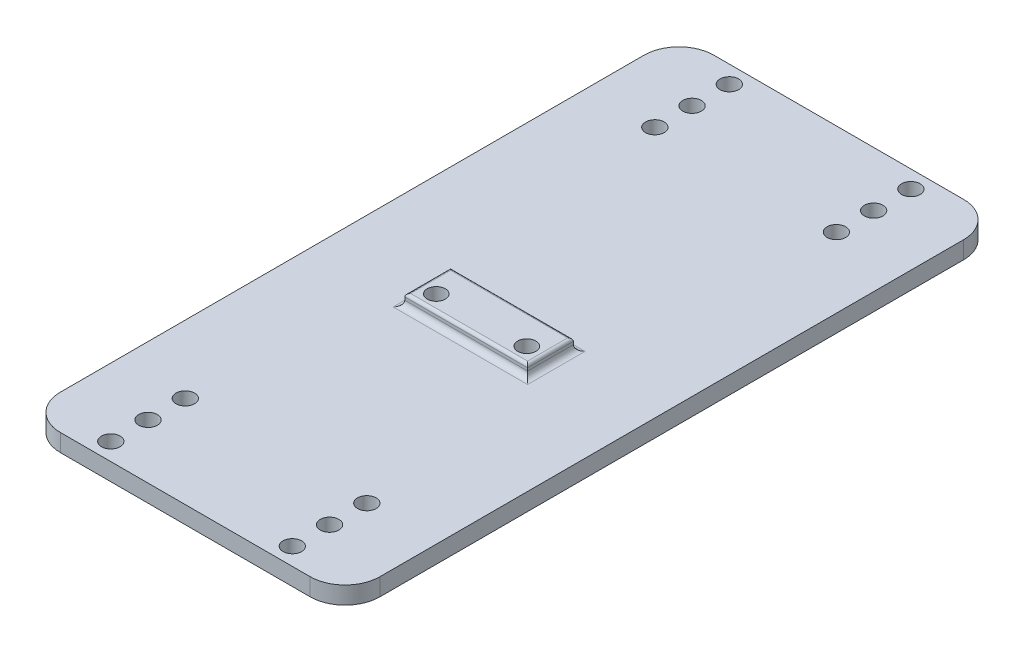
ISO-10303-21;
HEADER;
FILE_DESCRIPTION(('STEP AP214'),'2;1');
FILE_NAME('part.step','',(''),(''),'','','');
FILE_SCHEMA(('AUTOMOTIVE_DESIGN { 1 0 10303 214 1 1 1 1 }'));
ENDSEC;
DATA;
#1=APPLICATION_CONTEXT('core data for automotive mechanical design processes');
#2=APPLICATION_PROTOCOL_DEFINITION('international standard','automotive_design',2000,#1);
#3=PRODUCT_CONTEXT('',#1,'mechanical');
#4=PRODUCT('Part','Part','',(#3));
#5=PRODUCT_RELATED_PRODUCT_CATEGORY('part','',(#4));
#6=PRODUCT_DEFINITION_FORMATION('','',#4);
#7=PRODUCT_DEFINITION_CONTEXT('part definition',#1,'design');
#8=PRODUCT_DEFINITION('design','',#6,#7);
#9=PRODUCT_DEFINITION_SHAPE('','',#8);
#10=(LENGTH_UNIT() NAMED_UNIT(*) SI_UNIT(.MILLI.,.METRE.));
#11=(NAMED_UNIT(*) PLANE_ANGLE_UNIT() SI_UNIT($,.RADIAN.));
#12=(NAMED_UNIT(*) SI_UNIT($,.STERADIAN.) SOLID_ANGLE_UNIT());
#13=UNCERTAINTY_MEASURE_WITH_UNIT(LENGTH_MEASURE(1.E-05),#10,'distance_accuracy_value','');
#14=(GEOMETRIC_REPRESENTATION_CONTEXT(3) GLOBAL_UNCERTAINTY_ASSIGNED_CONTEXT((#13)) GLOBAL_UNIT_ASSIGNED_CONTEXT((#10,
#11,#12)) REPRESENTATION_CONTEXT('',''));
#15=CARTESIAN_POINT('',(0.,0.,0.));
#16=DIRECTION('',(0.,0.,1.));
#17=DIRECTION('',(1.,0.,0.));
#18=AXIS2_PLACEMENT_3D('',#15,#16,#17);
#19=CARTESIAN_POINT('',(0.,3.,0.));
#20=DIRECTION('',(0.,1.,0.));
#21=DIRECTION('',(0.,0.,1.));
#22=AXIS2_PLACEMENT_3D('',#19,#20,#21);
#23=PLANE('',#22);
#24=DIRECTION('',(1.,0.,0.));
#25=VECTOR('',#24,1.);
#26=CARTESIAN_POINT('',(0.,3.,-28.0852721253402));
#27=LINE('',#26,#25);
#28=CARTESIAN_POINT('',(-53.246105621832,3.,-28.0852721253402));
#29=VERTEX_POINT('',#28);
#30=CARTESIAN_POINT('',(-76.3535056218319,3.,-28.0852721253402));
#31=VERTEX_POINT('',#30);
#32=EDGE_CURVE('E220',#29,#31,#27,.F.);
#33=ORIENTED_EDGE('',*,*,#32,.T.);
#34=DIRECTION('',(0.,0.,-1.));
#35=VECTOR('',#34,1.);
#36=CARTESIAN_POINT('',(-76.3535056218319,3.,-36.9592721253402));
#37=LINE('',#36,#35);
#38=CARTESIAN_POINT('',(-76.3535056218319,3.,-37.9592721253402));
#39=VERTEX_POINT('',#38);
#40=EDGE_CURVE('E224',#31,#39,#37,.T.);
#41=ORIENTED_EDGE('',*,*,#40,.T.);
#42=DIRECTION('',(1.,0.,0.));
#43=VECTOR('',#42,1.);
#44=CARTESIAN_POINT('',(-54.246105621832,3.,-37.9592721253402));
#45=LINE('',#44,#43);
#46=CARTESIAN_POINT('',(-53.246105621832,3.,-37.9592721253402));
#47=VERTEX_POINT('',#46);
#48=EDGE_CURVE('E222',#39,#47,#45,.T.);
#49=ORIENTED_EDGE('',*,*,#48,.T.);
#50=DIRECTION('',(0.,0.,-1.));
#51=VECTOR('',#50,1.);
#52=CARTESIAN_POINT('',(-53.246105621832,3.,0.));
#53=LINE('',#52,#51);
#54=EDGE_CURVE('E218',#47,#29,#53,.F.);
#55=ORIENTED_EDGE('',*,*,#54,.T.);
#56=EDGE_LOOP('',(#33,#41,#49,#55));
#57=FACE_BOUND('',#56,.T.);
#58=CARTESIAN_POINT('',(-80.5998056218321,3.,-83.7102133679597));
#59=DIRECTION('',(0.,1.,0.));
#60=DIRECTION('',(0.,0.,-1.));
#61=AXIS2_PLACEMENT_3D('',#58,#59,#60);
#62=CIRCLE('',#61,1.60000000000001);
#63=CARTESIAN_POINT('',(-80.5998056218321,3.,-85.3102133679597));
#64=VERTEX_POINT('',#63);
#65=EDGE_CURVE('E331',#64,#64,#62,.T.);
#66=ORIENTED_EDGE('',*,*,#65,.F.);
#67=EDGE_LOOP('',(#66));
#68=FACE_BOUND('',#67,.T.);
#69=CARTESIAN_POINT('',(-49.3998056218321,3.,-77.3102133679595));
#70=DIRECTION('',(0.,1.,0.));
#71=DIRECTION('',(0.,0.,-1.));
#72=AXIS2_PLACEMENT_3D('',#69,#70,#71);
#73=CIRCLE('',#72,1.60000000000001);
#74=CARTESIAN_POINT('',(-49.3998056218321,3.,-78.9102133679596));
#75=VERTEX_POINT('',#74);
#76=EDGE_CURVE('E343',#75,#75,#73,.T.);
#77=ORIENTED_EDGE('',*,*,#76,.F.);
#78=EDGE_LOOP('',(#77));
#79=FACE_BOUND('',#78,.T.);
#80=CARTESIAN_POINT('',(-49.399805621832,3.,-90.1102133679596));
#81=DIRECTION('',(0.,1.,0.));
#82=DIRECTION('',(0.,0.,-1.));
#83=AXIS2_PLACEMENT_3D('',#80,#81,#82);
#84=CIRCLE('',#83,1.60000000000001);
#85=CARTESIAN_POINT('',(-49.399805621832,3.,-91.7102133679596));
#86=VERTEX_POINT('',#85);
#87=EDGE_CURVE('E355',#86,#86,#84,.T.);
#88=ORIENTED_EDGE('',*,*,#87,.F.);
#89=EDGE_LOOP('',(#88));
#90=FACE_BOUND('',#89,.T.);
#91=CARTESIAN_POINT('',(-49.399805621832,3.,9.79166911727908));
#92=DIRECTION('',(0.,1.,0.));
#93=DIRECTION('',(0.,0.,1.));
#94=AXIS2_PLACEMENT_3D('',#91,#92,#93);
#95=CIRCLE('',#94,1.6);
#96=CARTESIAN_POINT('',(-49.399805621832,3.,11.3916691172791));
#97=VERTEX_POINT('',#96);
#98=EDGE_CURVE('E367',#97,#97,#95,.T.);
#99=ORIENTED_EDGE('',*,*,#98,.F.);
#100=EDGE_LOOP('',(#99));
#101=FACE_BOUND('',#100,.T.);
#102=CARTESIAN_POINT('',(-80.5998056218321,3.,3.39166911727918));
#103=DIRECTION('',(0.,1.,0.));
#104=DIRECTION('',(0.,0.,1.));
#105=AXIS2_PLACEMENT_3D('',#102,#103,#104);
#106=CIRCLE('',#105,1.59999999999999);
#107=CARTESIAN_POINT('',(-80.5998056218321,3.,4.99166911727917));
#108=VERTEX_POINT('',#107);
#109=EDGE_CURVE('E379',#108,#108,#106,.T.);
#110=ORIENTED_EDGE('',*,*,#109,.F.);
#111=EDGE_LOOP('',(#110));
#112=FACE_BOUND('',#111,.T.);
#113=CARTESIAN_POINT('',(-80.599805621832,3.,16.1916691172792));
#114=DIRECTION('',(0.,1.,0.));
#115=DIRECTION('',(0.,0.,1.));
#116=AXIS2_PLACEMENT_3D('',#113,#114,#115);
#117=CIRCLE('',#116,1.59999999999999);
#118=CARTESIAN_POINT('',(-80.599805621832,3.,17.7916691172792));
#119=VERTEX_POINT('',#118);
#120=EDGE_CURVE('E177',#119,#119,#117,.T.);
#121=ORIENTED_EDGE('',*,*,#120,.F.);
#122=EDGE_LOOP('',(#121));
#123=FACE_BOUND('',#122,.T.);
#124=DIRECTION('',(-1.,0.,0.));
#125=VECTOR('',#124,1.);
#126=CARTESIAN_POINT('',(-92.2619387616021,3.,-93.1142721253402));
#127=LINE('',#126,#125);
#128=CARTESIAN_POINT('',(-43.3376724820618,3.,-93.1142721253402));
#129=VERTEX_POINT('',#128);
#130=CARTESIAN_POINT('',(-86.2619387616021,3.,-93.1142721253402));
#131=VERTEX_POINT('',#130);
#132=EDGE_CURVE('E186',#129,#131,#127,.T.);
#133=ORIENTED_EDGE('',*,*,#132,.T.);
#134=CARTESIAN_POINT('',(-86.2619387616021,3.,-87.1142721253402));
#135=DIRECTION('',(0.,1.,0.));
#136=DIRECTION('',(0.,0.,1.));
#137=AXIS2_PLACEMENT_3D('',#134,#135,#136);
#138=CIRCLE('',#137,6.);
#139=CARTESIAN_POINT('',(-92.2619387616021,3.,-87.1142721253402));
#140=VERTEX_POINT('',#139);
#141=EDGE_CURVE('E206',#131,#140,#138,.T.);
#142=ORIENTED_EDGE('',*,*,#141,.T.);
#143=DIRECTION('',(0.,0.,1.));
#144=VECTOR('',#143,1.);
#145=CARTESIAN_POINT('',(-92.2619387616021,3.,-93.1142721253402));
#146=LINE('',#145,#144);
#147=CARTESIAN_POINT('',(-92.2619387616021,3.,13.1957278746598));
#148=VERTEX_POINT('',#147);
#149=EDGE_CURVE('E168',#140,#148,#146,.T.);
#150=ORIENTED_EDGE('',*,*,#149,.T.);
#151=CARTESIAN_POINT('',(-86.2619387616021,3.,13.1957278746598));
#152=DIRECTION('',(0.,1.,0.));
#153=DIRECTION('',(0.,0.,1.));
#154=AXIS2_PLACEMENT_3D('',#151,#152,#153);
#155=CIRCLE('',#154,6.);
#156=CARTESIAN_POINT('',(-86.2619387616021,3.,19.1957278746598));
#157=VERTEX_POINT('',#156);
#158=EDGE_CURVE('E202',#148,#157,#155,.T.);
#159=ORIENTED_EDGE('',*,*,#158,.T.);
#160=DIRECTION('',(1.,0.,0.));
#161=VECTOR('',#160,1.);
#162=CARTESIAN_POINT('',(-92.2619387616021,3.,19.1957278746598));
#163=LINE('',#162,#161);
#164=CARTESIAN_POINT('',(-43.3376724820618,3.,19.1957278746598));
#165=VERTEX_POINT('',#164);
#166=EDGE_CURVE('E393',#157,#165,#163,.T.);
#167=ORIENTED_EDGE('',*,*,#166,.T.);
#168=CARTESIAN_POINT('',(-43.3376724820618,3.,13.1957278746598));
#169=DIRECTION('',(0.,1.,0.));
#170=DIRECTION('',(0.,0.,1.));
#171=AXIS2_PLACEMENT_3D('',#168,#169,#170);
#172=CIRCLE('',#171,6.);
#173=CARTESIAN_POINT('',(-37.3376724820618,3.,13.1957278746598));
#174=VERTEX_POINT('',#173);
#175=EDGE_CURVE('E200',#165,#174,#172,.T.);
#176=ORIENTED_EDGE('',*,*,#175,.T.);
#177=DIRECTION('',(0.,0.,-1.));
#178=VECTOR('',#177,1.);
#179=CARTESIAN_POINT('',(-37.3376724820618,3.,19.1957278746598));
#180=LINE('',#179,#178);
#181=CARTESIAN_POINT('',(-37.3376724820618,3.,-87.1142721253402));
#182=VERTEX_POINT('',#181);
#183=EDGE_CURVE('E395',#174,#182,#180,.T.);
#184=ORIENTED_EDGE('',*,*,#183,.T.);
#185=CARTESIAN_POINT('',(-43.3376724820618,3.,-87.1142721253402));
#186=DIRECTION('',(0.,1.,0.));
#187=DIRECTION('',(0.,0.,1.));
#188=AXIS2_PLACEMENT_3D('',#185,#186,#187);
#189=CIRCLE('',#188,6.);
#190=EDGE_CURVE('E204',#182,#129,#189,.T.);
#191=ORIENTED_EDGE('',*,*,#190,.T.);
#192=EDGE_LOOP('',(#133,#142,#150,#159,#167,#176,#184,#191));
#193=FACE_BOUND('',#192,.T.);
#194=CARTESIAN_POINT('',(-80.599805621832,3.,9.79166911727919));
#195=DIRECTION('',(0.,1.,0.));
#196=DIRECTION('',(0.,0.,1.));
#197=AXIS2_PLACEMENT_3D('',#194,#195,#196);
#198=CIRCLE('',#197,1.6);
#199=CARTESIAN_POINT('',(-80.599805621832,3.,11.3916691172792));
#200=VERTEX_POINT('',#199);
#201=EDGE_CURVE('E385',#200,#200,#198,.T.);
#202=ORIENTED_EDGE('',*,*,#201,.F.);
#203=EDGE_LOOP('',(#202));
#204=FACE_BOUND('',#203,.T.);
#205=CARTESIAN_POINT('',(-49.3998056218321,3.,3.39166911727908));
#206=DIRECTION('',(0.,1.,0.));
#207=DIRECTION('',(0.,0.,1.));
#208=AXIS2_PLACEMENT_3D('',#205,#206,#207);
#209=CIRCLE('',#208,1.60000000000001);
#210=CARTESIAN_POINT('',(-49.3998056218321,3.,4.99166911727909));
#211=VERTEX_POINT('',#210);
#212=EDGE_CURVE('E373',#211,#211,#209,.T.);
#213=ORIENTED_EDGE('',*,*,#212,.F.);
#214=EDGE_LOOP('',(#213));
#215=FACE_BOUND('',#214,.T.);
#216=CARTESIAN_POINT('',(-49.399805621832,3.,16.1916691172791));
#217=DIRECTION('',(0.,1.,0.));
#218=DIRECTION('',(0.,0.,1.));
#219=AXIS2_PLACEMENT_3D('',#216,#217,#218);
#220=CIRCLE('',#219,1.6);
#221=CARTESIAN_POINT('',(-49.399805621832,3.,17.7916691172791));
#222=VERTEX_POINT('',#221);
#223=EDGE_CURVE('E361',#222,#222,#220,.T.);
#224=ORIENTED_EDGE('',*,*,#223,.F.);
#225=EDGE_LOOP('',(#224));
#226=FACE_BOUND('',#225,.T.);
#227=CARTESIAN_POINT('',(-49.399805621832,3.,-83.7102133679596));
#228=DIRECTION('',(0.,1.,0.));
#229=DIRECTION('',(0.,0.,-1.));
#230=AXIS2_PLACEMENT_3D('',#227,#228,#229);
#231=CIRCLE('',#230,1.60000000000001);
#232=CARTESIAN_POINT('',(-49.399805621832,3.,-85.3102133679596));
#233=VERTEX_POINT('',#232);
#234=EDGE_CURVE('E349',#233,#233,#231,.T.);
#235=ORIENTED_EDGE('',*,*,#234,.F.);
#236=EDGE_LOOP('',(#235));
#237=FACE_BOUND('',#236,.T.);
#238=CARTESIAN_POINT('',(-80.5998056218321,3.,-77.3102133679596));
#239=DIRECTION('',(0.,1.,0.));
#240=DIRECTION('',(0.,0.,-1.));
#241=AXIS2_PLACEMENT_3D('',#238,#239,#240);
#242=CIRCLE('',#241,1.59999999999999);
#243=CARTESIAN_POINT('',(-80.5998056218321,3.,-78.9102133679596));
#244=VERTEX_POINT('',#243);
#245=EDGE_CURVE('E337',#244,#244,#242,.T.);
#246=ORIENTED_EDGE('',*,*,#245,.F.);
#247=EDGE_LOOP('',(#246));
#248=FACE_BOUND('',#247,.T.);
#249=CARTESIAN_POINT('',(-80.599805621832,3.,-90.1102133679596));
#250=DIRECTION('',(0.,1.,0.));
#251=DIRECTION('',(0.,0.,-1.));
#252=AXIS2_PLACEMENT_3D('',#249,#250,#251);
#253=CIRCLE('',#252,1.59999999999999);
#254=CARTESIAN_POINT('',(-80.599805621832,3.,-91.7102133679596));
#255=VERTEX_POINT('',#254);
#256=EDGE_CURVE('E325',#255,#255,#253,.T.);
#257=ORIENTED_EDGE('',*,*,#256,.F.);
#258=EDGE_LOOP('',(#257));
#259=FACE_BOUND('',#258,.T.);
#260=ADVANCED_FACE('F35',(#57,#68,#79,#90,#101,#112,#123,#193,#204,#215,#226,#237,#248,#259),
#23,.T.);
#261=CARTESIAN_POINT('',(0.,0.,0.));
#262=DIRECTION('',(0.,1.,0.));
#263=DIRECTION('',(0.,0.,1.));
#264=AXIS2_PLACEMENT_3D('',#261,#262,#263);
#265=PLANE('',#264);
#266=CARTESIAN_POINT('',(-57.0215252853927,0.,-31.7197684137691));
#267=DIRECTION('',(0.,1.,0.));
#268=DIRECTION('',(0.,0.,1.));
#269=AXIS2_PLACEMENT_3D('',#266,#267,#268);
#270=CIRCLE('',#269,1.55575000000001);
#271=CARTESIAN_POINT('',(-57.0215252853927,0.,-30.1640184137691));
#272=VERTEX_POINT('',#271);
#273=EDGE_CURVE('E251',#272,#272,#270,.F.);
#274=ORIENTED_EDGE('',*,*,#273,.F.);
#275=EDGE_LOOP('',(#274));
#276=FACE_BOUND('',#275,.T.);
#277=CARTESIAN_POINT('',(-72.578555621832,0.,-31.7205221253402));
#278=DIRECTION('',(0.,1.,0.));
#279=DIRECTION('',(0.,0.,1.));
#280=AXIS2_PLACEMENT_3D('',#277,#278,#279);
#281=CIRCLE('',#280,1.55575000000001);
#282=CARTESIAN_POINT('',(-72.578555621832,0.,-30.1647721253402));
#283=VERTEX_POINT('',#282);
#284=EDGE_CURVE('E316',#283,#283,#281,.T.);
#285=ORIENTED_EDGE('',*,*,#284,.T.);
#286=EDGE_LOOP('',(#285));
#287=FACE_BOUND('',#286,.T.);
#288=DIRECTION('',(0.,0.,1.));
#289=VECTOR('',#288,1.);
#290=CARTESIAN_POINT('',(-92.2619387616021,0.,-93.1142721253402));
#291=LINE('',#290,#289);
#292=CARTESIAN_POINT('',(-92.2619387616021,0.,-87.1142721253402));
#293=VERTEX_POINT('',#292);
#294=CARTESIAN_POINT('',(-92.2619387616021,0.,13.1957278746598));
#295=VERTEX_POINT('',#294);
#296=EDGE_CURVE('E165',#293,#295,#291,.T.);
#297=ORIENTED_EDGE('',*,*,#296,.F.);
#298=CARTESIAN_POINT('',(-86.2619387616021,0.,-87.1142721253402));
#299=DIRECTION('',(0.,1.,0.));
#300=DIRECTION('',(0.,0.,1.));
#301=AXIS2_PLACEMENT_3D('',#298,#299,#300);
#302=CIRCLE('',#301,6.);
#303=CARTESIAN_POINT('',(-86.2619387616021,0.,-93.1142721253402));
#304=VERTEX_POINT('',#303);
#305=EDGE_CURVE('E148',#293,#304,#302,.F.);
#306=ORIENTED_EDGE('',*,*,#305,.T.);
#307=DIRECTION('',(-1.,0.,0.));
#308=VECTOR('',#307,1.);
#309=CARTESIAN_POINT('',(-92.2619387616021,0.,-93.1142721253402));
#310=LINE('',#309,#308);
#311=CARTESIAN_POINT('',(-43.3376724820618,0.,-93.1142721253402));
#312=VERTEX_POINT('',#311);
#313=EDGE_CURVE('E191',#312,#304,#310,.T.);
#314=ORIENTED_EDGE('',*,*,#313,.F.);
#315=CARTESIAN_POINT('',(-43.3376724820618,0.,-87.1142721253402));
#316=DIRECTION('',(0.,1.,0.));
#317=DIRECTION('',(0.,0.,1.));
#318=AXIS2_PLACEMENT_3D('',#315,#316,#317);
#319=CIRCLE('',#318,6.);
#320=CARTESIAN_POINT('',(-37.3376724820618,0.,-87.1142721253402));
#321=VERTEX_POINT('',#320);
#322=EDGE_CURVE('E159',#312,#321,#319,.F.);
#323=ORIENTED_EDGE('',*,*,#322,.T.);
#324=DIRECTION('',(0.,0.,-1.));
#325=VECTOR('',#324,1.);
#326=CARTESIAN_POINT('',(-37.3376724820618,0.,19.1957278746598));
#327=LINE('',#326,#325);
#328=CARTESIAN_POINT('',(-37.3376724820618,0.,13.1957278746598));
#329=VERTEX_POINT('',#328);
#330=EDGE_CURVE('E180',#329,#321,#327,.T.);
#331=ORIENTED_EDGE('',*,*,#330,.F.);
#332=CARTESIAN_POINT('',(-43.3376724820618,0.,13.1957278746598));
#333=DIRECTION('',(0.,1.,0.));
#334=DIRECTION('',(0.,0.,1.));
#335=AXIS2_PLACEMENT_3D('',#332,#333,#334);
#336=CIRCLE('',#335,6.);
#337=CARTESIAN_POINT('',(-43.3376724820618,0.,19.1957278746598));
#338=VERTEX_POINT('',#337);
#339=EDGE_CURVE('E169',#329,#338,#336,.F.);
#340=ORIENTED_EDGE('',*,*,#339,.T.);
#341=DIRECTION('',(1.,0.,0.));
#342=VECTOR('',#341,1.);
#343=CARTESIAN_POINT('',(-92.2619387616021,0.,19.1957278746598));
#344=LINE('',#343,#342);
#345=CARTESIAN_POINT('',(-86.2619387616021,0.,19.1957278746598));
#346=VERTEX_POINT('',#345);
#347=EDGE_CURVE('E176',#346,#338,#344,.T.);
#348=ORIENTED_EDGE('',*,*,#347,.F.);
#349=CARTESIAN_POINT('',(-86.2619387616021,0.,13.1957278746598));
#350=DIRECTION('',(0.,1.,0.));
#351=DIRECTION('',(0.,0.,1.));
#352=AXIS2_PLACEMENT_3D('',#349,#350,#351);
#353=CIRCLE('',#352,6.);
#354=EDGE_CURVE('E175',#346,#295,#353,.F.);
#355=ORIENTED_EDGE('',*,*,#354,.T.);
#356=EDGE_LOOP('',(#297,#306,#314,#323,#331,#340,#348,#355));
#357=FACE_BOUND('',#356,.T.);
#358=CARTESIAN_POINT('',(-80.599805621832,0.,16.1916691172792));
#359=DIRECTION('',(0.,1.,0.));
#360=DIRECTION('',(0.,0.,1.));
#361=AXIS2_PLACEMENT_3D('',#358,#359,#360);
#362=CIRCLE('',#361,1.59999999999999);
#363=CARTESIAN_POINT('',(-80.599805621832,0.,17.7916691172792));
#364=VERTEX_POINT('',#363);
#365=EDGE_CURVE('E183',#364,#364,#362,.T.);
#366=ORIENTED_EDGE('',*,*,#365,.T.);
#367=EDGE_LOOP('',(#366));
#368=FACE_BOUND('',#367,.T.);
#369=CARTESIAN_POINT('',(-80.599805621832,0.,9.79166911727919));
#370=DIRECTION('',(0.,1.,0.));
#371=DIRECTION('',(0.,0.,1.));
#372=AXIS2_PLACEMENT_3D('',#369,#370,#371);
#373=CIRCLE('',#372,1.6);
#374=CARTESIAN_POINT('',(-80.599805621832,0.,11.3916691172792));
#375=VERTEX_POINT('',#374);
#376=EDGE_CURVE('E382',#375,#375,#373,.T.);
#377=ORIENTED_EDGE('',*,*,#376,.T.);
#378=EDGE_LOOP('',(#377));
#379=FACE_BOUND('',#378,.T.);
#380=CARTESIAN_POINT('',(-80.5998056218321,0.,3.39166911727918));
#381=DIRECTION('',(0.,1.,0.));
#382=DIRECTION('',(0.,0.,1.));
#383=AXIS2_PLACEMENT_3D('',#380,#381,#382);
#384=CIRCLE('',#383,1.59999999999999);
#385=CARTESIAN_POINT('',(-80.5998056218321,0.,4.99166911727917));
#386=VERTEX_POINT('',#385);
#387=EDGE_CURVE('E376',#386,#386,#384,.T.);
#388=ORIENTED_EDGE('',*,*,#387,.T.);
#389=EDGE_LOOP('',(#388));
#390=FACE_BOUND('',#389,.T.);
#391=CARTESIAN_POINT('',(-49.3998056218321,0.,3.39166911727908));
#392=DIRECTION('',(0.,1.,0.));
#393=DIRECTION('',(0.,0.,1.));
#394=AXIS2_PLACEMENT_3D('',#391,#392,#393);
#395=CIRCLE('',#394,1.60000000000001);
#396=CARTESIAN_POINT('',(-49.3998056218321,0.,4.99166911727909));
#397=VERTEX_POINT('',#396);
#398=EDGE_CURVE('E370',#397,#397,#395,.T.);
#399=ORIENTED_EDGE('',*,*,#398,.T.);
#400=EDGE_LOOP('',(#399));
#401=FACE_BOUND('',#400,.T.);
#402=CARTESIAN_POINT('',(-49.399805621832,0.,9.79166911727908));
#403=DIRECTION('',(0.,1.,0.));
#404=DIRECTION('',(0.,0.,1.));
#405=AXIS2_PLACEMENT_3D('',#402,#403,#404);
#406=CIRCLE('',#405,1.6);
#407=CARTESIAN_POINT('',(-49.399805621832,0.,11.3916691172791));
#408=VERTEX_POINT('',#407);
#409=EDGE_CURVE('E364',#408,#408,#406,.T.);
#410=ORIENTED_EDGE('',*,*,#409,.T.);
#411=EDGE_LOOP('',(#410));
#412=FACE_BOUND('',#411,.T.);
#413=CARTESIAN_POINT('',(-49.399805621832,0.,16.1916691172791));
#414=DIRECTION('',(0.,1.,0.));
#415=DIRECTION('',(0.,0.,1.));
#416=AXIS2_PLACEMENT_3D('',#413,#414,#415);
#417=CIRCLE('',#416,1.6);
#418=CARTESIAN_POINT('',(-49.399805621832,0.,17.7916691172791));
#419=VERTEX_POINT('',#418);
#420=EDGE_CURVE('E358',#419,#419,#417,.T.);
#421=ORIENTED_EDGE('',*,*,#420,.T.);
#422=EDGE_LOOP('',(#421));
#423=FACE_BOUND('',#422,.T.);
#424=CARTESIAN_POINT('',(-49.399805621832,0.,-90.1102133679596));
#425=DIRECTION('',(0.,1.,0.));
#426=DIRECTION('',(0.,0.,-1.));
#427=AXIS2_PLACEMENT_3D('',#424,#425,#426);
#428=CIRCLE('',#427,1.60000000000001);
#429=CARTESIAN_POINT('',(-49.399805621832,0.,-91.7102133679596));
#430=VERTEX_POINT('',#429);
#431=EDGE_CURVE('E352',#430,#430,#428,.T.);
#432=ORIENTED_EDGE('',*,*,#431,.T.);
#433=EDGE_LOOP('',(#432));
#434=FACE_BOUND('',#433,.T.);
#435=CARTESIAN_POINT('',(-49.399805621832,0.,-83.7102133679596));
#436=DIRECTION('',(0.,1.,0.));
#437=DIRECTION('',(0.,0.,-1.));
#438=AXIS2_PLACEMENT_3D('',#435,#436,#437);
#439=CIRCLE('',#438,1.60000000000001);
#440=CARTESIAN_POINT('',(-49.399805621832,0.,-85.3102133679596));
#441=VERTEX_POINT('',#440);
#442=EDGE_CURVE('E346',#441,#441,#439,.T.);
#443=ORIENTED_EDGE('',*,*,#442,.T.);
#444=EDGE_LOOP('',(#443));
#445=FACE_BOUND('',#444,.T.);
#446=CARTESIAN_POINT('',(-49.3998056218321,0.,-77.3102133679595));
#447=DIRECTION('',(0.,1.,0.));
#448=DIRECTION('',(0.,0.,-1.));
#449=AXIS2_PLACEMENT_3D('',#446,#447,#448);
#450=CIRCLE('',#449,1.60000000000001);
#451=CARTESIAN_POINT('',(-49.3998056218321,0.,-78.9102133679596));
#452=VERTEX_POINT('',#451);
#453=EDGE_CURVE('E340',#452,#452,#450,.T.);
#454=ORIENTED_EDGE('',*,*,#453,.T.);
#455=EDGE_LOOP('',(#454));
#456=FACE_BOUND('',#455,.T.);
#457=CARTESIAN_POINT('',(-80.5998056218321,0.,-77.3102133679596));
#458=DIRECTION('',(0.,1.,0.));
#459=DIRECTION('',(0.,0.,-1.));
#460=AXIS2_PLACEMENT_3D('',#457,#458,#459);
#461=CIRCLE('',#460,1.59999999999999);
#462=CARTESIAN_POINT('',(-80.5998056218321,0.,-78.9102133679596));
#463=VERTEX_POINT('',#462);
#464=EDGE_CURVE('E334',#463,#463,#461,.T.);
#465=ORIENTED_EDGE('',*,*,#464,.T.);
#466=EDGE_LOOP('',(#465));
#467=FACE_BOUND('',#466,.T.);
#468=CARTESIAN_POINT('',(-80.5998056218321,0.,-83.7102133679597));
#469=DIRECTION('',(0.,1.,0.));
#470=DIRECTION('',(0.,0.,-1.));
#471=AXIS2_PLACEMENT_3D('',#468,#469,#470);
#472=CIRCLE('',#471,1.60000000000001);
#473=CARTESIAN_POINT('',(-80.5998056218321,0.,-85.3102133679597));
#474=VERTEX_POINT('',#473);
#475=EDGE_CURVE('E328',#474,#474,#472,.T.);
#476=ORIENTED_EDGE('',*,*,#475,.T.);
#477=EDGE_LOOP('',(#476));
#478=FACE_BOUND('',#477,.T.);
#479=CARTESIAN_POINT('',(-80.599805621832,0.,-90.1102133679596));
#480=DIRECTION('',(0.,1.,0.));
#481=DIRECTION('',(0.,0.,-1.));
#482=AXIS2_PLACEMENT_3D('',#479,#480,#481);
#483=CIRCLE('',#482,1.59999999999999);
#484=CARTESIAN_POINT('',(-80.599805621832,0.,-91.7102133679596));
#485=VERTEX_POINT('',#484);
#486=EDGE_CURVE('E324',#485,#485,#483,.T.);
#487=ORIENTED_EDGE('',*,*,#486,.T.);
#488=EDGE_LOOP('',(#487));
#489=FACE_BOUND('',#488,.T.);
#490=ADVANCED_FACE('F172',(#276,#287,#357,#368,#379,#390,#401,#412,#423,#434,#445,#456,#467,
#478,#489),#265,.F.);
#491=CARTESIAN_POINT('',(-92.2619387616021,3.,-93.1142721253402));
#492=DIRECTION('',(1.,0.,0.));
#493=DIRECTION('',(0.,0.,-1.));
#494=AXIS2_PLACEMENT_3D('',#491,#492,#493);
#495=PLANE('',#494);
#496=ORIENTED_EDGE('',*,*,#149,.F.);
#497=DIRECTION('',(0.,-1.,0.));
#498=VECTOR('',#497,1.);
#499=CARTESIAN_POINT('',(-92.2619387616021,3.,-87.1142721253402));
#500=LINE('',#499,#498);
#501=EDGE_CURVE('E152',#140,#293,#500,.T.);
#502=ORIENTED_EDGE('',*,*,#501,.T.);
#503=ORIENTED_EDGE('',*,*,#296,.T.);
#504=DIRECTION('',(0.,-1.,0.));
#505=VECTOR('',#504,1.);
#506=CARTESIAN_POINT('',(-92.2619387616021,3.,13.1957278746598));
#507=LINE('',#506,#505);
#508=EDGE_CURVE('E170',#295,#148,#507,.F.);
#509=ORIENTED_EDGE('',*,*,#508,.T.);
#510=EDGE_LOOP('',(#496,#502,#503,#509));
#511=FACE_BOUND('',#510,.T.);
#512=ADVANCED_FACE('F164',(#511),#495,.F.);
#513=CARTESIAN_POINT('',(-92.2619387616021,3.,19.1957278746598));
#514=DIRECTION('',(0.,0.,-1.));
#515=DIRECTION('',(-1.,0.,0.));
#516=AXIS2_PLACEMENT_3D('',#513,#514,#515);
#517=PLANE('',#516);
#518=ORIENTED_EDGE('',*,*,#166,.F.);
#519=DIRECTION('',(0.,-1.,0.));
#520=VECTOR('',#519,1.);
#521=CARTESIAN_POINT('',(-86.2619387616021,3.,19.1957278746598));
#522=LINE('',#521,#520);
#523=EDGE_CURVE('E215',#157,#346,#522,.T.);
#524=ORIENTED_EDGE('',*,*,#523,.T.);
#525=ORIENTED_EDGE('',*,*,#347,.T.);
#526=DIRECTION('',(0.,-1.,0.));
#527=VECTOR('',#526,1.);
#528=CARTESIAN_POINT('',(-43.3376724820618,3.,19.1957278746598));
#529=LINE('',#528,#527);
#530=EDGE_CURVE('E213',#338,#165,#529,.F.);
#531=ORIENTED_EDGE('',*,*,#530,.T.);
#532=EDGE_LOOP('',(#518,#524,#525,#531));
#533=FACE_BOUND('',#532,.T.);
#534=ADVANCED_FACE('F419',(#533),#517,.F.);
#535=CARTESIAN_POINT('',(-37.3376724820618,3.,19.1957278746598));
#536=DIRECTION('',(-1.,0.,0.));
#537=DIRECTION('',(0.,0.,1.));
#538=AXIS2_PLACEMENT_3D('',#535,#536,#537);
#539=PLANE('',#538);
#540=ORIENTED_EDGE('',*,*,#330,.T.);
#541=DIRECTION('',(0.,-1.,0.));
#542=VECTOR('',#541,1.);
#543=CARTESIAN_POINT('',(-37.3376724820618,3.,-87.1142721253402));
#544=LINE('',#543,#542);
#545=EDGE_CURVE('E211',#321,#182,#544,.F.);
#546=ORIENTED_EDGE('',*,*,#545,.T.);
#547=ORIENTED_EDGE('',*,*,#183,.F.);
#548=DIRECTION('',(0.,-1.,0.));
#549=VECTOR('',#548,1.);
#550=CARTESIAN_POINT('',(-37.3376724820618,3.,13.1957278746598));
#551=LINE('',#550,#549);
#552=EDGE_CURVE('E208',#174,#329,#551,.T.);
#553=ORIENTED_EDGE('',*,*,#552,.T.);
#554=EDGE_LOOP('',(#540,#546,#547,#553));
#555=FACE_BOUND('',#554,.T.);
#556=ADVANCED_FACE('F411',(#555),#539,.F.);
#557=CARTESIAN_POINT('',(-92.2619387616021,3.,-93.1142721253402));
#558=DIRECTION('',(0.,0.,1.));
#559=DIRECTION('',(1.,0.,0.));
#560=AXIS2_PLACEMENT_3D('',#557,#558,#559);
#561=PLANE('',#560);
#562=ORIENTED_EDGE('',*,*,#313,.T.);
#563=DIRECTION('',(0.,-1.,0.));
#564=VECTOR('',#563,1.);
#565=CARTESIAN_POINT('',(-86.2619387616021,3.,-93.1142721253402));
#566=LINE('',#565,#564);
#567=EDGE_CURVE('E153',#304,#131,#566,.F.);
#568=ORIENTED_EDGE('',*,*,#567,.T.);
#569=ORIENTED_EDGE('',*,*,#132,.F.);
#570=DIRECTION('',(0.,-1.,0.));
#571=VECTOR('',#570,1.);
#572=CARTESIAN_POINT('',(-43.3376724820618,3.,-93.1142721253402));
#573=LINE('',#572,#571);
#574=EDGE_CURVE('E158',#129,#312,#573,.T.);
#575=ORIENTED_EDGE('',*,*,#574,.T.);
#576=EDGE_LOOP('',(#562,#568,#569,#575));
#577=FACE_BOUND('',#576,.T.);
#578=ADVANCED_FACE('F405',(#577),#561,.F.);
#579=CARTESIAN_POINT('',(-80.599805621832,3.,16.1916691172792));
#580=DIRECTION('',(0.,-1.,0.));
#581=DIRECTION('',(0.,0.,-1.));
#582=AXIS2_PLACEMENT_3D('',#579,#580,#581);
#583=CYLINDRICAL_SURFACE('',#582,1.59999999999999);
#584=ORIENTED_EDGE('',*,*,#120,.T.);
#585=EDGE_LOOP('',(#584));
#586=FACE_BOUND('',#585,.T.);
#587=ORIENTED_EDGE('',*,*,#365,.F.);
#588=EDGE_LOOP('',(#587));
#589=FACE_BOUND('',#588,.T.);
#590=ADVANCED_FACE('F442',(#586,#589),#583,.F.);
#591=CARTESIAN_POINT('',(-80.599805621832,3.,9.79166911727919));
#592=DIRECTION('',(0.,-1.,0.));
#593=DIRECTION('',(0.,0.,-1.));
#594=AXIS2_PLACEMENT_3D('',#591,#592,#593);
#595=CYLINDRICAL_SURFACE('',#594,1.6);
#596=ORIENTED_EDGE('',*,*,#201,.T.);
#597=EDGE_LOOP('',(#596));
#598=FACE_BOUND('',#597,.T.);
#599=ORIENTED_EDGE('',*,*,#376,.F.);
#600=EDGE_LOOP('',(#599));
#601=FACE_BOUND('',#600,.T.);
#602=ADVANCED_FACE('F500',(#598,#601),#595,.F.);
#603=CARTESIAN_POINT('',(-80.5998056218321,3.,3.39166911727918));
#604=DIRECTION('',(0.,-1.,0.));
#605=DIRECTION('',(0.,0.,-1.));
#606=AXIS2_PLACEMENT_3D('',#603,#604,#605);
#607=CYLINDRICAL_SURFACE('',#606,1.59999999999999);
#608=ORIENTED_EDGE('',*,*,#109,.T.);
#609=EDGE_LOOP('',(#608));
#610=FACE_BOUND('',#609,.T.);
#611=ORIENTED_EDGE('',*,*,#387,.F.);
#612=EDGE_LOOP('',(#611));
#613=FACE_BOUND('',#612,.T.);
#614=ADVANCED_FACE('F497',(#610,#613),#607,.F.);
#615=CARTESIAN_POINT('',(-49.3998056218321,3.,3.39166911727908));
#616=DIRECTION('',(0.,-1.,0.));
#617=DIRECTION('',(0.,0.,-1.));
#618=AXIS2_PLACEMENT_3D('',#615,#616,#617);
#619=CYLINDRICAL_SURFACE('',#618,1.60000000000001);
#620=ORIENTED_EDGE('',*,*,#212,.T.);
#621=EDGE_LOOP('',(#620));
#622=FACE_BOUND('',#621,.T.);
#623=ORIENTED_EDGE('',*,*,#398,.F.);
#624=EDGE_LOOP('',(#623));
#625=FACE_BOUND('',#624,.T.);
#626=ADVANCED_FACE('F493',(#622,#625),#619,.F.);
#627=CARTESIAN_POINT('',(-49.399805621832,3.,9.79166911727908));
#628=DIRECTION('',(0.,-1.,0.));
#629=DIRECTION('',(0.,0.,-1.));
#630=AXIS2_PLACEMENT_3D('',#627,#628,#629);
#631=CYLINDRICAL_SURFACE('',#630,1.6);
#632=ORIENTED_EDGE('',*,*,#98,.T.);
#633=EDGE_LOOP('',(#632));
#634=FACE_BOUND('',#633,.T.);
#635=ORIENTED_EDGE('',*,*,#409,.F.);
#636=EDGE_LOOP('',(#635));
#637=FACE_BOUND('',#636,.T.);
#638=ADVANCED_FACE('F489',(#634,#637),#631,.F.);
#639=CARTESIAN_POINT('',(-49.399805621832,3.,16.1916691172791));
#640=DIRECTION('',(0.,-1.,0.));
#641=DIRECTION('',(0.,0.,-1.));
#642=AXIS2_PLACEMENT_3D('',#639,#640,#641);
#643=CYLINDRICAL_SURFACE('',#642,1.6);
#644=ORIENTED_EDGE('',*,*,#223,.T.);
#645=EDGE_LOOP('',(#644));
#646=FACE_BOUND('',#645,.T.);
#647=ORIENTED_EDGE('',*,*,#420,.F.);
#648=EDGE_LOOP('',(#647));
#649=FACE_BOUND('',#648,.T.);
#650=ADVANCED_FACE('F485',(#646,#649),#643,.F.);
#651=CARTESIAN_POINT('',(-49.399805621832,3.,-90.1102133679596));
#652=DIRECTION('',(0.,-1.,0.));
#653=DIRECTION('',(0.,0.,-1.));
#654=AXIS2_PLACEMENT_3D('',#651,#652,#653);
#655=CYLINDRICAL_SURFACE('',#654,1.60000000000001);
#656=ORIENTED_EDGE('',*,*,#87,.T.);
#657=EDGE_LOOP('',(#656));
#658=FACE_BOUND('',#657,.T.);
#659=ORIENTED_EDGE('',*,*,#431,.F.);
#660=EDGE_LOOP('',(#659));
#661=FACE_BOUND('',#660,.T.);
#662=ADVANCED_FACE('F481',(#658,#661),#655,.F.);
#663=CARTESIAN_POINT('',(-49.399805621832,3.,-83.7102133679596));
#664=DIRECTION('',(0.,-1.,0.));
#665=DIRECTION('',(0.,0.,-1.));
#666=AXIS2_PLACEMENT_3D('',#663,#664,#665);
#667=CYLINDRICAL_SURFACE('',#666,1.60000000000001);
#668=ORIENTED_EDGE('',*,*,#234,.T.);
#669=EDGE_LOOP('',(#668));
#670=FACE_BOUND('',#669,.T.);
#671=ORIENTED_EDGE('',*,*,#442,.F.);
#672=EDGE_LOOP('',(#671));
#673=FACE_BOUND('',#672,.T.);
#674=ADVANCED_FACE('F477',(#670,#673),#667,.F.);
#675=CARTESIAN_POINT('',(-49.3998056218321,3.,-77.3102133679595));
#676=DIRECTION('',(0.,-1.,0.));
#677=DIRECTION('',(0.,0.,-1.));
#678=AXIS2_PLACEMENT_3D('',#675,#676,#677);
#679=CYLINDRICAL_SURFACE('',#678,1.60000000000001);
#680=ORIENTED_EDGE('',*,*,#76,.T.);
#681=EDGE_LOOP('',(#680));
#682=FACE_BOUND('',#681,.T.);
#683=ORIENTED_EDGE('',*,*,#453,.F.);
#684=EDGE_LOOP('',(#683));
#685=FACE_BOUND('',#684,.T.);
#686=ADVANCED_FACE('F473',(#682,#685),#679,.F.);
#687=CARTESIAN_POINT('',(-80.5998056218321,3.,-77.3102133679596));
#688=DIRECTION('',(0.,-1.,0.));
#689=DIRECTION('',(0.,0.,-1.));
#690=AXIS2_PLACEMENT_3D('',#687,#688,#689);
#691=CYLINDRICAL_SURFACE('',#690,1.59999999999999);
#692=ORIENTED_EDGE('',*,*,#245,.T.);
#693=EDGE_LOOP('',(#692));
#694=FACE_BOUND('',#693,.T.);
#695=ORIENTED_EDGE('',*,*,#464,.F.);
#696=EDGE_LOOP('',(#695));
#697=FACE_BOUND('',#696,.T.);
#698=ADVANCED_FACE('F464',(#694,#697),#691,.F.);
#699=CARTESIAN_POINT('',(-80.5998056218321,3.,-83.7102133679597));
#700=DIRECTION('',(0.,-1.,0.));
#701=DIRECTION('',(0.,0.,-1.));
#702=AXIS2_PLACEMENT_3D('',#699,#700,#701);
#703=CYLINDRICAL_SURFACE('',#702,1.60000000000001);
#704=ORIENTED_EDGE('',*,*,#65,.T.);
#705=EDGE_LOOP('',(#704));
#706=FACE_BOUND('',#705,.T.);
#707=ORIENTED_EDGE('',*,*,#475,.F.);
#708=EDGE_LOOP('',(#707));
#709=FACE_BOUND('',#708,.T.);
#710=ADVANCED_FACE('F458',(#706,#709),#703,.F.);
#711=CARTESIAN_POINT('',(-80.599805621832,3.,-90.1102133679596));
#712=DIRECTION('',(0.,-1.,0.));
#713=DIRECTION('',(0.,0.,-1.));
#714=AXIS2_PLACEMENT_3D('',#711,#712,#713);
#715=CYLINDRICAL_SURFACE('',#714,1.59999999999999);
#716=ORIENTED_EDGE('',*,*,#256,.T.);
#717=EDGE_LOOP('',(#716));
#718=FACE_BOUND('',#717,.T.);
#719=ORIENTED_EDGE('',*,*,#486,.F.);
#720=EDGE_LOOP('',(#719));
#721=FACE_BOUND('',#720,.T.);
#722=ADVANCED_FACE('F454',(#718,#721),#715,.F.);
#723=CARTESIAN_POINT('',(-86.2619387616021,3.,-87.1142721253402));
#724=DIRECTION('',(0.,-1.,0.));
#725=DIRECTION('',(0.,0.,-1.));
#726=AXIS2_PLACEMENT_3D('',#723,#724,#725);
#727=CYLINDRICAL_SURFACE('',#726,6.);
#728=ORIENTED_EDGE('',*,*,#141,.F.);
#729=ORIENTED_EDGE('',*,*,#567,.F.);
#730=ORIENTED_EDGE('',*,*,#305,.F.);
#731=ORIENTED_EDGE('',*,*,#501,.F.);
#732=EDGE_LOOP('',(#728,#729,#730,#731));
#733=FACE_BOUND('',#732,.T.);
#734=ADVANCED_FACE('F151',(#733),#727,.T.);
#735=CARTESIAN_POINT('',(-43.3376724820618,3.,-87.1142721253402));
#736=DIRECTION('',(0.,-1.,0.));
#737=DIRECTION('',(0.,0.,-1.));
#738=AXIS2_PLACEMENT_3D('',#735,#736,#737);
#739=CYLINDRICAL_SURFACE('',#738,6.);
#740=ORIENTED_EDGE('',*,*,#190,.F.);
#741=ORIENTED_EDGE('',*,*,#545,.F.);
#742=ORIENTED_EDGE('',*,*,#322,.F.);
#743=ORIENTED_EDGE('',*,*,#574,.F.);
#744=EDGE_LOOP('',(#740,#741,#742,#743));
#745=FACE_BOUND('',#744,.T.);
#746=ADVANCED_FACE('F407',(#745),#739,.T.);
#747=CARTESIAN_POINT('',(-86.2619387616021,3.,13.1957278746598));
#748=DIRECTION('',(0.,-1.,0.));
#749=DIRECTION('',(0.,0.,-1.));
#750=AXIS2_PLACEMENT_3D('',#747,#748,#749);
#751=CYLINDRICAL_SURFACE('',#750,6.);
#752=ORIENTED_EDGE('',*,*,#158,.F.);
#753=ORIENTED_EDGE('',*,*,#508,.F.);
#754=ORIENTED_EDGE('',*,*,#354,.F.);
#755=ORIENTED_EDGE('',*,*,#523,.F.);
#756=EDGE_LOOP('',(#752,#753,#754,#755));
#757=FACE_BOUND('',#756,.T.);
#758=ADVANCED_FACE('F423',(#757),#751,.T.);
#759=CARTESIAN_POINT('',(-43.3376724820618,3.,13.1957278746598));
#760=DIRECTION('',(0.,-1.,0.));
#761=DIRECTION('',(0.,0.,-1.));
#762=AXIS2_PLACEMENT_3D('',#759,#760,#761);
#763=CYLINDRICAL_SURFACE('',#762,6.);
#764=ORIENTED_EDGE('',*,*,#175,.F.);
#765=ORIENTED_EDGE('',*,*,#530,.F.);
#766=ORIENTED_EDGE('',*,*,#339,.F.);
#767=ORIENTED_EDGE('',*,*,#552,.F.);
#768=EDGE_LOOP('',(#764,#765,#766,#767));
#769=FACE_BOUND('',#768,.T.);
#770=ADVANCED_FACE('F415',(#769),#763,.T.);
#771=CARTESIAN_POINT('',(0.,5.,-36.9592721253402));
#772=DIRECTION('',(0.,0.,-1.));
#773=DIRECTION('',(-1.,0.,0.));
#774=AXIS2_PLACEMENT_3D('',#771,#772,#773);
#775=PLANE('',#774);
#776=DIRECTION('',(0.,-1.,0.));
#777=VECTOR('',#776,1.);
#778=CARTESIAN_POINT('',(-75.3535056218319,5.,-36.9592721253402));
#779=LINE('',#778,#777);
#780=CARTESIAN_POINT('',(-75.3535056218319,4.5,-36.9592721253402));
#781=VERTEX_POINT('',#780);
#782=CARTESIAN_POINT('',(-75.3535056218319,4.,-36.9592721253402));
#783=VERTEX_POINT('',#782);
#784=EDGE_CURVE('E289',#781,#783,#779,.T.);
#785=ORIENTED_EDGE('',*,*,#784,.F.);
#786=DIRECTION('',(1.,0.,0.));
#787=VECTOR('',#786,1.);
#788=CARTESIAN_POINT('',(0.,4.5,-36.9592721253402));
#789=LINE('',#788,#787);
#790=CARTESIAN_POINT('',(-54.246105621832,4.5,-36.9592721253402));
#791=VERTEX_POINT('',#790);
#792=EDGE_CURVE('E263',#781,#791,#789,.T.);
#793=ORIENTED_EDGE('',*,*,#792,.T.);
#794=DIRECTION('',(0.,-1.,0.));
#795=VECTOR('',#794,1.);
#796=CARTESIAN_POINT('',(-54.246105621832,5.,-36.9592721253402));
#797=LINE('',#796,#795);
#798=CARTESIAN_POINT('',(-54.246105621832,4.,-36.9592721253402));
#799=VERTEX_POINT('',#798);
#800=EDGE_CURVE('E288',#791,#799,#797,.T.);
#801=ORIENTED_EDGE('',*,*,#800,.T.);
#802=DIRECTION('',(1.,0.,0.));
#803=VECTOR('',#802,1.);
#804=CARTESIAN_POINT('',(-75.3535056218319,4.,-36.9592721253402));
#805=LINE('',#804,#803);
#806=EDGE_CURVE('E230',#799,#783,#805,.F.);
#807=ORIENTED_EDGE('',*,*,#806,.T.);
#808=EDGE_LOOP('',(#785,#793,#801,#807));
#809=FACE_BOUND('',#808,.T.);
#810=ADVANCED_FACE('F287',(#809),#775,.T.);
#811=CARTESIAN_POINT('',(-75.3535056218319,5.,0.));
#812=DIRECTION('',(-1.,0.,0.));
#813=DIRECTION('',(0.,0.,1.));
#814=AXIS2_PLACEMENT_3D('',#811,#812,#813);
#815=PLANE('',#814);
#816=DIRECTION('',(0.,-1.,0.));
#817=VECTOR('',#816,1.);
#818=CARTESIAN_POINT('',(-75.3535056218319,5.,-29.0852721253402));
#819=LINE('',#818,#817);
#820=CARTESIAN_POINT('',(-75.3535056218319,4.5,-29.0852721253402));
#821=VERTEX_POINT('',#820);
#822=CARTESIAN_POINT('',(-75.3535056218319,4.,-29.0852721253402));
#823=VERTEX_POINT('',#822);
#824=EDGE_CURVE('E321',#821,#823,#819,.T.);
#825=ORIENTED_EDGE('',*,*,#824,.F.);
#826=DIRECTION('',(0.,0.,-1.));
#827=VECTOR('',#826,1.);
#828=CARTESIAN_POINT('',(-75.3535056218319,4.5,0.));
#829=LINE('',#828,#827);
#830=EDGE_CURVE('E44',#821,#781,#829,.T.);
#831=ORIENTED_EDGE('',*,*,#830,.T.);
#832=ORIENTED_EDGE('',*,*,#784,.T.);
#833=DIRECTION('',(0.,0.,-1.));
#834=VECTOR('',#833,1.);
#835=CARTESIAN_POINT('',(-75.3535056218319,4.,-29.0852721253402));
#836=LINE('',#835,#834);
#837=EDGE_CURVE('E227',#783,#823,#836,.F.);
#838=ORIENTED_EDGE('',*,*,#837,.T.);
#839=EDGE_LOOP('',(#825,#831,#832,#838));
#840=FACE_BOUND('',#839,.T.);
#841=ADVANCED_FACE('F658',(#840),#815,.T.);
#842=CARTESIAN_POINT('',(0.,5.,-29.0852721253402));
#843=DIRECTION('',(0.,0.,-1.));
#844=DIRECTION('',(-1.,0.,0.));
#845=AXIS2_PLACEMENT_3D('',#842,#843,#844);
#846=PLANE('',#845);
#847=DIRECTION('',(0.,-1.,0.));
#848=VECTOR('',#847,1.);
#849=CARTESIAN_POINT('',(-54.246105621832,5.,-29.0852721253402));
#850=LINE('',#849,#848);
#851=CARTESIAN_POINT('',(-54.246105621832,4.5,-29.0852721253402));
#852=VERTEX_POINT('',#851);
#853=CARTESIAN_POINT('',(-54.246105621832,4.,-29.0852721253402));
#854=VERTEX_POINT('',#853);
#855=EDGE_CURVE('E295',#852,#854,#850,.T.);
#856=ORIENTED_EDGE('',*,*,#855,.F.);
#857=DIRECTION('',(1.,0.,0.));
#858=VECTOR('',#857,1.);
#859=CARTESIAN_POINT('',(-75.3535056218319,4.5,-29.0852721253402));
#860=LINE('',#859,#858);
#861=EDGE_CURVE('E11',#852,#821,#860,.F.);
#862=ORIENTED_EDGE('',*,*,#861,.T.);
#863=ORIENTED_EDGE('',*,*,#824,.T.);
#864=DIRECTION('',(1.,0.,0.));
#865=VECTOR('',#864,1.);
#866=CARTESIAN_POINT('',(0.,4.,-29.0852721253402));
#867=LINE('',#866,#865);
#868=EDGE_CURVE('E233',#823,#854,#867,.T.);
#869=ORIENTED_EDGE('',*,*,#868,.T.);
#870=EDGE_LOOP('',(#856,#862,#863,#869));
#871=FACE_BOUND('',#870,.T.);
#872=ADVANCED_FACE('F591',(#871),#846,.F.);
#873=CARTESIAN_POINT('',(-72.578555621832,5.,-31.7205221253402));
#874=DIRECTION('',(0.,-1.,0.));
#875=DIRECTION('',(0.,0.,-1.));
#876=AXIS2_PLACEMENT_3D('',#873,#874,#875);
#877=CYLINDRICAL_SURFACE('',#876,1.55575000000001);
#878=CARTESIAN_POINT('',(-72.578555621832,5.,-31.7205221253402));
#879=DIRECTION('',(0.,1.,0.));
#880=DIRECTION('',(0.,0.,1.));
#881=AXIS2_PLACEMENT_3D('',#878,#879,#880);
#882=CIRCLE('',#881,1.55575000000001);
#883=CARTESIAN_POINT('',(-72.578555621832,5.,-30.1647721253402));
#884=VERTEX_POINT('',#883);
#885=EDGE_CURVE('E311',#884,#884,#882,.T.);
#886=ORIENTED_EDGE('',*,*,#885,.T.);
#887=EDGE_LOOP('',(#886));
#888=FACE_BOUND('',#887,.T.);
#889=ORIENTED_EDGE('',*,*,#284,.F.);
#890=EDGE_LOOP('',(#889));
#891=FACE_BOUND('',#890,.T.);
#892=ADVANCED_FACE('F586',(#888,#891),#877,.F.);
#893=CARTESIAN_POINT('',(-54.246105621832,5.,0.));
#894=DIRECTION('',(-1.,0.,0.));
#895=DIRECTION('',(0.,0.,1.));
#896=AXIS2_PLACEMENT_3D('',#893,#894,#895);
#897=PLANE('',#896);
#898=ORIENTED_EDGE('',*,*,#800,.F.);
#899=DIRECTION('',(0.,0.,-1.));
#900=VECTOR('',#899,1.);
#901=CARTESIAN_POINT('',(-54.246105621832,4.5,-29.0852721253402));
#902=LINE('',#901,#900);
#903=EDGE_CURVE('E260',#791,#852,#902,.F.);
#904=ORIENTED_EDGE('',*,*,#903,.T.);
#905=ORIENTED_EDGE('',*,*,#855,.T.);
#906=DIRECTION('',(0.,0.,-1.));
#907=VECTOR('',#906,1.);
#908=CARTESIAN_POINT('',(-54.246105621832,4.,0.));
#909=LINE('',#908,#907);
#910=EDGE_CURVE('E236',#854,#799,#909,.T.);
#911=ORIENTED_EDGE('',*,*,#910,.T.);
#912=EDGE_LOOP('',(#898,#904,#905,#911));
#913=FACE_BOUND('',#912,.T.);
#914=ADVANCED_FACE('F292',(#913),#897,.F.);
#915=CARTESIAN_POINT('',(-57.0215252853927,5.,-31.7197684137691));
#916=DIRECTION('',(0.,-1.,0.));
#917=DIRECTION('',(0.,0.,-1.));
#918=AXIS2_PLACEMENT_3D('',#915,#916,#917);
#919=CYLINDRICAL_SURFACE('',#918,1.55575000000001);
#920=CARTESIAN_POINT('',(-57.0215252853927,5.,-31.7197684137691));
#921=DIRECTION('',(0.,1.,0.));
#922=DIRECTION('',(0.,0.,1.));
#923=AXIS2_PLACEMENT_3D('',#920,#921,#922);
#924=CIRCLE('',#923,1.55575000000001);
#925=CARTESIAN_POINT('',(-57.0215252853927,5.,-30.1640184137691));
#926=VERTEX_POINT('',#925);
#927=EDGE_CURVE('E296',#926,#926,#924,.F.);
#928=ORIENTED_EDGE('',*,*,#927,.F.);
#929=EDGE_LOOP('',(#928));
#930=FACE_BOUND('',#929,.T.);
#931=ORIENTED_EDGE('',*,*,#273,.T.);
#932=EDGE_LOOP('',(#931));
#933=FACE_BOUND('',#932,.T.);
#934=ADVANCED_FACE('F306',(#930,#933),#919,.F.);
#935=CARTESIAN_POINT('',(0.,5.,0.));
#936=DIRECTION('',(0.,1.,0.));
#937=DIRECTION('',(0.,0.,1.));
#938=AXIS2_PLACEMENT_3D('',#935,#936,#937);
#939=PLANE('',#938);
#940=DIRECTION('',(1.,0.,0.));
#941=VECTOR('',#940,1.);
#942=CARTESIAN_POINT('',(-54.246105621832,5.,-29.5852721253402));
#943=LINE('',#942,#941);
#944=CARTESIAN_POINT('',(-74.8535056218319,5.,-29.5852721253402));
#945=VERTEX_POINT('',#944);
#946=CARTESIAN_POINT('',(-54.746105621832,5.,-29.5852721253402));
#947=VERTEX_POINT('',#946);
#948=EDGE_CURVE('E239',#945,#947,#943,.T.);
#949=ORIENTED_EDGE('',*,*,#948,.T.);
#950=DIRECTION('',(0.,0.,-1.));
#951=VECTOR('',#950,1.);
#952=CARTESIAN_POINT('',(-54.746105621832,5.,-36.9592721253402));
#953=LINE('',#952,#951);
#954=CARTESIAN_POINT('',(-54.746105621832,5.,-36.4592721253402));
#955=VERTEX_POINT('',#954);
#956=EDGE_CURVE('E257',#947,#955,#953,.T.);
#957=ORIENTED_EDGE('',*,*,#956,.T.);
#958=DIRECTION('',(1.,0.,0.));
#959=VECTOR('',#958,1.);
#960=CARTESIAN_POINT('',(0.,5.,-36.4592721253402));
#961=LINE('',#960,#959);
#962=CARTESIAN_POINT('',(-74.8535056218319,5.,-36.4592721253402));
#963=VERTEX_POINT('',#962);
#964=EDGE_CURVE('E255',#955,#963,#961,.F.);
#965=ORIENTED_EDGE('',*,*,#964,.T.);
#966=DIRECTION('',(0.,0.,-1.));
#967=VECTOR('',#966,1.);
#968=CARTESIAN_POINT('',(-74.8535056218319,5.,0.));
#969=LINE('',#968,#967);
#970=EDGE_CURVE('E253',#963,#945,#969,.F.);
#971=ORIENTED_EDGE('',*,*,#970,.T.);
#972=EDGE_LOOP('',(#949,#957,#965,#971));
#973=FACE_BOUND('',#972,.T.);
#974=ORIENTED_EDGE('',*,*,#885,.F.);
#975=EDGE_LOOP('',(#974));
#976=FACE_BOUND('',#975,.T.);
#977=ORIENTED_EDGE('',*,*,#927,.T.);
#978=EDGE_LOOP('',(#977));
#979=FACE_BOUND('',#978,.T.);
#980=ADVANCED_FACE('F302',(#973,#976,#979),#939,.T.);
#981=CARTESIAN_POINT('',(-53.246105621832,4.,0.));
#982=DIRECTION('',(0.,0.,-1.));
#983=DIRECTION('',(-1.,0.,0.));
#984=AXIS2_PLACEMENT_3D('',#981,#982,#983);
#985=CYLINDRICAL_SURFACE('',#984,1.);
#986=CARTESIAN_POINT('',(-53.246105621832,4.,-37.9592721253402));
#987=DIRECTION('',(-0.707106781186547,0.,-0.707106781186547));
#988=DIRECTION('',(0.707106781186547,0.,-0.707106781186547));
#989=AXIS2_PLACEMENT_3D('',#986,#987,#988);
#990=ELLIPSE('',#989,1.41421356237309,1.);
#991=EDGE_CURVE('E245',#799,#47,#990,.F.);
#992=ORIENTED_EDGE('',*,*,#991,.F.);
#993=ORIENTED_EDGE('',*,*,#910,.F.);
#994=CARTESIAN_POINT('',(-53.246105621832,4.,-28.0852721253402));
#995=DIRECTION('',(0.707106781186547,0.,-0.707106781186547));
#996=DIRECTION('',(-0.707106781186547,0.,-0.707106781186547));
#997=AXIS2_PLACEMENT_3D('',#994,#995,#996);
#998=ELLIPSE('',#997,1.41421356237309,1.);
#999=EDGE_CURVE('E248',#29,#854,#998,.T.);
#1000=ORIENTED_EDGE('',*,*,#999,.F.);
#1001=ORIENTED_EDGE('',*,*,#54,.F.);
#1002=EDGE_LOOP('',(#992,#993,#1000,#1001));
#1003=FACE_BOUND('',#1002,.T.);
#1004=ADVANCED_FACE('F305',(#1003),#985,.F.);
#1005=CARTESIAN_POINT('',(0.,4.,-28.0852721253402));
#1006=DIRECTION('',(1.,0.,0.));
#1007=DIRECTION('',(0.,0.,-1.));
#1008=AXIS2_PLACEMENT_3D('',#1005,#1006,#1007);
#1009=CYLINDRICAL_SURFACE('',#1008,1.);
#1010=ORIENTED_EDGE('',*,*,#999,.T.);
#1011=ORIENTED_EDGE('',*,*,#868,.F.);
#1012=CARTESIAN_POINT('',(-76.3535056218319,4.,-28.0852721253402));
#1013=DIRECTION('',(0.707106781186547,0.,0.707106781186547));
#1014=DIRECTION('',(0.707106781186547,0.,-0.707106781186547));
#1015=AXIS2_PLACEMENT_3D('',#1012,#1013,#1014);
#1016=ELLIPSE('',#1015,1.41421356237309,1.);
#1017=EDGE_CURVE('E242',#31,#823,#1016,.T.);
#1018=ORIENTED_EDGE('',*,*,#1017,.F.);
#1019=ORIENTED_EDGE('',*,*,#32,.F.);
#1020=EDGE_LOOP('',(#1010,#1011,#1018,#1019));
#1021=FACE_BOUND('',#1020,.T.);
#1022=ADVANCED_FACE('F617',(#1021),#1009,.F.);
#1023=CARTESIAN_POINT('',(0.,4.,-37.9592721253402));
#1024=DIRECTION('',(-1.,0.,0.));
#1025=DIRECTION('',(0.,0.,1.));
#1026=AXIS2_PLACEMENT_3D('',#1023,#1024,#1025);
#1027=CYLINDRICAL_SURFACE('',#1026,1.);
#1028=ORIENTED_EDGE('',*,*,#991,.T.);
#1029=ORIENTED_EDGE('',*,*,#48,.F.);
#1030=CARTESIAN_POINT('',(-76.3535056218319,4.,-37.9592721253402));
#1031=DIRECTION('',(-0.707106781186547,0.,0.707106781186547));
#1032=DIRECTION('',(-0.707106781186547,0.,-0.707106781186547));
#1033=AXIS2_PLACEMENT_3D('',#1030,#1031,#1032);
#1034=ELLIPSE('',#1033,1.41421356237309,1.);
#1035=EDGE_CURVE('E240',#783,#39,#1034,.F.);
#1036=ORIENTED_EDGE('',*,*,#1035,.F.);
#1037=ORIENTED_EDGE('',*,*,#806,.F.);
#1038=EDGE_LOOP('',(#1028,#1029,#1036,#1037));
#1039=FACE_BOUND('',#1038,.T.);
#1040=ADVANCED_FACE('F627',(#1039),#1027,.F.);
#1041=CARTESIAN_POINT('',(-76.3535056218319,4.,0.));
#1042=DIRECTION('',(0.,0.,1.));
#1043=DIRECTION('',(1.,0.,0.));
#1044=AXIS2_PLACEMENT_3D('',#1041,#1042,#1043);
#1045=CYLINDRICAL_SURFACE('',#1044,1.);
#1046=ORIENTED_EDGE('',*,*,#1017,.T.);
#1047=ORIENTED_EDGE('',*,*,#837,.F.);
#1048=ORIENTED_EDGE('',*,*,#1035,.T.);
#1049=ORIENTED_EDGE('',*,*,#40,.F.);
#1050=EDGE_LOOP('',(#1046,#1047,#1048,#1049));
#1051=FACE_BOUND('',#1050,.T.);
#1052=ADVANCED_FACE('F637',(#1051),#1045,.F.);
#1053=CARTESIAN_POINT('',(-74.8535056218319,4.5,0.));
#1054=DIRECTION('',(0.,0.,-1.));
#1055=DIRECTION('',(-1.,0.,0.));
#1056=AXIS2_PLACEMENT_3D('',#1053,#1054,#1055);
#1057=CYLINDRICAL_SURFACE('',#1056,0.5);
#1058=CARTESIAN_POINT('',(-74.8535056218319,4.5,-36.4592721253402));
#1059=DIRECTION('',(0.707106781186547,0.,-0.707106781186547));
#1060=DIRECTION('',(-0.707106781186547,0.,-0.707106781186547));
#1061=AXIS2_PLACEMENT_3D('',#1058,#1059,#1060);
#1062=ELLIPSE('',#1061,0.707106781186547,0.5);
#1063=EDGE_CURVE('E269',#781,#963,#1062,.T.);
#1064=ORIENTED_EDGE('',*,*,#1063,.F.);
#1065=ORIENTED_EDGE('',*,*,#830,.F.);
#1066=CARTESIAN_POINT('',(-74.8535056218319,4.5,-29.5852721253402));
#1067=DIRECTION('',(-0.707106781186547,0.,-0.707106781186547));
#1068=DIRECTION('',(-0.707106781186547,0.,0.707106781186547));
#1069=AXIS2_PLACEMENT_3D('',#1066,#1067,#1068);
#1070=ELLIPSE('',#1069,0.707106781186547,0.5);
#1071=EDGE_CURVE('E39',#945,#821,#1070,.F.);
#1072=ORIENTED_EDGE('',*,*,#1071,.F.);
#1073=ORIENTED_EDGE('',*,*,#970,.F.);
#1074=EDGE_LOOP('',(#1064,#1065,#1072,#1073));
#1075=FACE_BOUND('',#1074,.T.);
#1076=ADVANCED_FACE('F37',(#1075),#1057,.T.);
#1077=CARTESIAN_POINT('',(0.,4.5,-29.5852721253402));
#1078=DIRECTION('',(-1.,0.,0.));
#1079=DIRECTION('',(0.,0.,1.));
#1080=AXIS2_PLACEMENT_3D('',#1077,#1078,#1079);
#1081=CYLINDRICAL_SURFACE('',#1080,0.5);
#1082=ORIENTED_EDGE('',*,*,#1071,.T.);
#1083=ORIENTED_EDGE('',*,*,#861,.F.);
#1084=CARTESIAN_POINT('',(-54.746105621832,4.5,-29.5852721253402));
#1085=DIRECTION('',(-0.707106781186547,0.,0.707106781186547));
#1086=DIRECTION('',(-0.707106781186547,0.,-0.707106781186547));
#1087=AXIS2_PLACEMENT_3D('',#1084,#1085,#1086);
#1088=ELLIPSE('',#1087,0.707106781186547,0.5);
#1089=EDGE_CURVE('E268',#947,#852,#1088,.F.);
#1090=ORIENTED_EDGE('',*,*,#1089,.F.);
#1091=ORIENTED_EDGE('',*,*,#948,.F.);
#1092=EDGE_LOOP('',(#1082,#1083,#1090,#1091));
#1093=FACE_BOUND('',#1092,.T.);
#1094=ADVANCED_FACE('F279',(#1093),#1081,.T.);
#1095=CARTESIAN_POINT('',(0.,4.5,-36.4592721253402));
#1096=DIRECTION('',(1.,0.,0.));
#1097=DIRECTION('',(0.,0.,-1.));
#1098=AXIS2_PLACEMENT_3D('',#1095,#1096,#1097);
#1099=CYLINDRICAL_SURFACE('',#1098,0.5);
#1100=ORIENTED_EDGE('',*,*,#1063,.T.);
#1101=ORIENTED_EDGE('',*,*,#964,.F.);
#1102=CARTESIAN_POINT('',(-54.746105621832,4.5,-36.4592721253402));
#1103=DIRECTION('',(0.707106781186547,0.,0.707106781186547));
#1104=DIRECTION('',(0.707106781186547,0.,-0.707106781186547));
#1105=AXIS2_PLACEMENT_3D('',#1102,#1103,#1104);
#1106=ELLIPSE('',#1105,0.707106781186547,0.5);
#1107=EDGE_CURVE('E266',#791,#955,#1106,.T.);
#1108=ORIENTED_EDGE('',*,*,#1107,.F.);
#1109=ORIENTED_EDGE('',*,*,#792,.F.);
#1110=EDGE_LOOP('',(#1100,#1101,#1108,#1109));
#1111=FACE_BOUND('',#1110,.T.);
#1112=ADVANCED_FACE('F284',(#1111),#1099,.T.);
#1113=CARTESIAN_POINT('',(-54.746105621832,4.5,0.));
#1114=DIRECTION('',(0.,0.,1.));
#1115=DIRECTION('',(1.,0.,0.));
#1116=AXIS2_PLACEMENT_3D('',#1113,#1114,#1115);
#1117=CYLINDRICAL_SURFACE('',#1116,0.5);
#1118=ORIENTED_EDGE('',*,*,#1089,.T.);
#1119=ORIENTED_EDGE('',*,*,#903,.F.);
#1120=ORIENTED_EDGE('',*,*,#1107,.T.);
#1121=ORIENTED_EDGE('',*,*,#956,.F.);
#1122=EDGE_LOOP('',(#1118,#1119,#1120,#1121));
#1123=FACE_BOUND('',#1122,.T.);
#1124=ADVANCED_FACE('F299',(#1123),#1117,.T.);
#1125=CLOSED_SHELL('',(#260,#490,#512,#534,#556,#578,#590,#602,#614,#626,#638,#650,#662,#674,
#686,#698,#710,#722,#734,#746,#758,#770,#810,#841,#872,#892,#914,#934,#980,#1004,#1022,#1040,
#1052,#1076,#1094,#1112,#1124));
#1126=MANIFOLD_SOLID_BREP('B2',#1125);
#1127=ADVANCED_BREP_SHAPE_REPRESENTATION('',(#18,#1126),#14);
#1128=SHAPE_DEFINITION_REPRESENTATION(#9,#1127);
ENDSEC;
END-ISO-10303-21;
